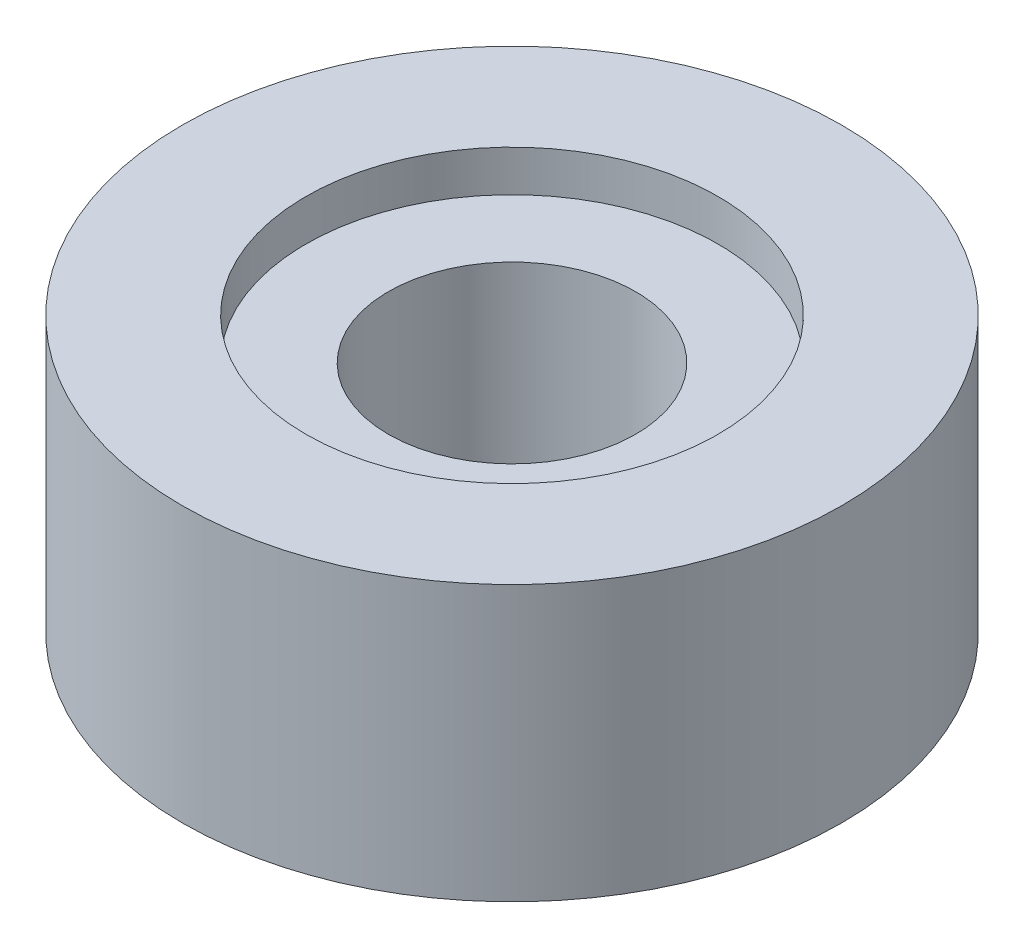
ISO-10303-21;
HEADER;
FILE_DESCRIPTION(('STEP AP214'),'2;1');
FILE_NAME('part.step','',(''),(''),'','','');
FILE_SCHEMA(('AUTOMOTIVE_DESIGN { 1 0 10303 214 1 1 1 1 }'));
ENDSEC;
DATA;
#1=APPLICATION_CONTEXT('core data for automotive mechanical design processes');
#2=APPLICATION_PROTOCOL_DEFINITION('international standard','automotive_design',2000,#1);
#3=PRODUCT_CONTEXT('',#1,'mechanical');
#4=PRODUCT('Part','Part','',(#3));
#5=PRODUCT_RELATED_PRODUCT_CATEGORY('part','',(#4));
#6=PRODUCT_DEFINITION_FORMATION('','',#4);
#7=PRODUCT_DEFINITION_CONTEXT('part definition',#1,'design');
#8=PRODUCT_DEFINITION('design','',#6,#7);
#9=PRODUCT_DEFINITION_SHAPE('','',#8);
#10=(LENGTH_UNIT() NAMED_UNIT(*) SI_UNIT(.MILLI.,.METRE.));
#11=(NAMED_UNIT(*) PLANE_ANGLE_UNIT() SI_UNIT($,.RADIAN.));
#12=(NAMED_UNIT(*) SI_UNIT($,.STERADIAN.) SOLID_ANGLE_UNIT());
#13=UNCERTAINTY_MEASURE_WITH_UNIT(LENGTH_MEASURE(1.E-05),#10,'distance_accuracy_value','');
#14=(GEOMETRIC_REPRESENTATION_CONTEXT(3) GLOBAL_UNCERTAINTY_ASSIGNED_CONTEXT((#13)) GLOBAL_UNIT_ASSIGNED_CONTEXT((#10,
#11,#12)) REPRESENTATION_CONTEXT('',''));
#15=CARTESIAN_POINT('',(0.,0.,0.));
#16=DIRECTION('',(0.,0.,1.));
#17=DIRECTION('',(1.,0.,0.));
#18=AXIS2_PLACEMENT_3D('',#15,#16,#17);
#19=CARTESIAN_POINT('',(0.,-0.00100000000000013,0.));
#20=DIRECTION('',(0.,1.,0.));
#21=DIRECTION('',(0.,0.,1.));
#22=AXIS2_PLACEMENT_3D('',#19,#20,#21);
#23=CYLINDRICAL_SURFACE('',#22,2.25);
#24=CARTESIAN_POINT('',(0.,0.,0.));
#25=DIRECTION('',(0.,1.,0.));
#26=DIRECTION('',(0.,0.,1.));
#27=AXIS2_PLACEMENT_3D('',#24,#25,#26);
#28=CIRCLE('',#27,2.25);
#29=CARTESIAN_POINT('',(0.,0.,2.25));
#30=VERTEX_POINT('',#29);
#31=EDGE_CURVE('E42',#30,#30,#28,.F.);
#32=ORIENTED_EDGE('',*,*,#31,.T.);
#33=EDGE_LOOP('',(#32));
#34=FACE_BOUND('',#33,.T.);
#35=CARTESIAN_POINT('',(0.,4.25,0.));
#36=DIRECTION('',(0.,1.,0.));
#37=DIRECTION('',(0.,0.,1.));
#38=AXIS2_PLACEMENT_3D('',#35,#36,#37);
#39=CIRCLE('',#38,2.25);
#40=CARTESIAN_POINT('',(0.,4.25,2.25));
#41=VERTEX_POINT('',#40);
#42=EDGE_CURVE('E33',#41,#41,#39,.F.);
#43=ORIENTED_EDGE('',*,*,#42,.F.);
#44=EDGE_LOOP('',(#43));
#45=FACE_BOUND('',#44,.T.);
#46=ADVANCED_FACE('F29',(#34,#45),#23,.F.);
#47=CARTESIAN_POINT('',(0.,5.,0.));
#48=DIRECTION('',(0.,-1.,0.));
#49=DIRECTION('',(0.,0.,-1.));
#50=AXIS2_PLACEMENT_3D('',#47,#48,#49);
#51=CYLINDRICAL_SURFACE('',#50,6.);
#52=CARTESIAN_POINT('',(0.,5.,0.));
#53=DIRECTION('',(0.,1.,0.));
#54=DIRECTION('',(0.,0.,1.));
#55=AXIS2_PLACEMENT_3D('',#52,#53,#54);
#56=CIRCLE('',#55,6.);
#57=CARTESIAN_POINT('',(0.,5.,6.));
#58=VERTEX_POINT('',#57);
#59=EDGE_CURVE('E10',#58,#58,#56,.T.);
#60=ORIENTED_EDGE('',*,*,#59,.F.);
#61=EDGE_LOOP('',(#60));
#62=FACE_BOUND('',#61,.T.);
#63=CARTESIAN_POINT('',(0.,0.,0.));
#64=DIRECTION('',(0.,1.,0.));
#65=DIRECTION('',(0.,0.,1.));
#66=AXIS2_PLACEMENT_3D('',#63,#64,#65);
#67=CIRCLE('',#66,6.);
#68=CARTESIAN_POINT('',(0.,0.,6.));
#69=VERTEX_POINT('',#68);
#70=EDGE_CURVE('E37',#69,#69,#67,.T.);
#71=ORIENTED_EDGE('',*,*,#70,.T.);
#72=EDGE_LOOP('',(#71));
#73=FACE_BOUND('',#72,.T.);
#74=ADVANCED_FACE('F31',(#62,#73),#51,.T.);
#75=CARTESIAN_POINT('',(0.,5.,0.));
#76=DIRECTION('',(0.,1.,0.));
#77=DIRECTION('',(0.,0.,1.));
#78=AXIS2_PLACEMENT_3D('',#75,#76,#77);
#79=PLANE('',#78);
#80=CARTESIAN_POINT('',(0.,5.,0.));
#81=DIRECTION('',(0.,1.,0.));
#82=DIRECTION('',(0.,0.,1.));
#83=AXIS2_PLACEMENT_3D('',#80,#81,#82);
#84=CIRCLE('',#83,3.75);
#85=CARTESIAN_POINT('',(0.,5.,3.75));
#86=VERTEX_POINT('',#85);
#87=EDGE_CURVE('E46',#86,#86,#84,.T.);
#88=ORIENTED_EDGE('',*,*,#87,.F.);
#89=EDGE_LOOP('',(#88));
#90=FACE_BOUND('',#89,.T.);
#91=ORIENTED_EDGE('',*,*,#59,.T.);
#92=EDGE_LOOP('',(#91));
#93=FACE_BOUND('',#92,.T.);
#94=ADVANCED_FACE('F64',(#90,#93),#79,.T.);
#95=CARTESIAN_POINT('',(0.,0.,0.));
#96=DIRECTION('',(0.,1.,0.));
#97=DIRECTION('',(0.,0.,1.));
#98=AXIS2_PLACEMENT_3D('',#95,#96,#97);
#99=PLANE('',#98);
#100=ORIENTED_EDGE('',*,*,#31,.F.);
#101=EDGE_LOOP('',(#100));
#102=FACE_BOUND('',#101,.T.);
#103=ORIENTED_EDGE('',*,*,#70,.F.);
#104=EDGE_LOOP('',(#103));
#105=FACE_BOUND('',#104,.T.);
#106=ADVANCED_FACE('F71',(#102,#105),#99,.F.);
#107=CARTESIAN_POINT('',(0.,4.25,0.));
#108=DIRECTION('',(0.,1.,0.));
#109=DIRECTION('',(0.,0.,1.));
#110=AXIS2_PLACEMENT_3D('',#107,#108,#109);
#111=PLANE('',#110);
#112=CARTESIAN_POINT('',(0.,4.25,0.));
#113=DIRECTION('',(0.,1.,0.));
#114=DIRECTION('',(0.,0.,1.));
#115=AXIS2_PLACEMENT_3D('',#112,#113,#114);
#116=CIRCLE('',#115,3.75);
#117=CARTESIAN_POINT('',(0.,4.25,3.75));
#118=VERTEX_POINT('',#117);
#119=EDGE_CURVE('E49',#118,#118,#116,.T.);
#120=ORIENTED_EDGE('',*,*,#119,.T.);
#121=EDGE_LOOP('',(#120));
#122=FACE_BOUND('',#121,.T.);
#123=ORIENTED_EDGE('',*,*,#42,.T.);
#124=EDGE_LOOP('',(#123));
#125=FACE_BOUND('',#124,.T.);
#126=ADVANCED_FACE('F56',(#122,#125),#111,.T.);
#127=CARTESIAN_POINT('',(0.,4.25,0.));
#128=DIRECTION('',(0.,1.,0.));
#129=DIRECTION('',(0.,0.,1.));
#130=AXIS2_PLACEMENT_3D('',#127,#128,#129);
#131=CYLINDRICAL_SURFACE('',#130,3.75);
#132=ORIENTED_EDGE('',*,*,#119,.F.);
#133=EDGE_LOOP('',(#132));
#134=FACE_BOUND('',#133,.T.);
#135=ORIENTED_EDGE('',*,*,#87,.T.);
#136=EDGE_LOOP('',(#135));
#137=FACE_BOUND('',#136,.T.);
#138=ADVANCED_FACE('F68',(#134,#137),#131,.F.);
#139=CLOSED_SHELL('',(#46,#74,#94,#106,#126,#138));
#140=MANIFOLD_SOLID_BREP('B2',#139);
#141=ADVANCED_BREP_SHAPE_REPRESENTATION('',(#18,#140),#14);
#142=SHAPE_DEFINITION_REPRESENTATION(#9,#141);
ENDSEC;
END-ISO-10303-21;
